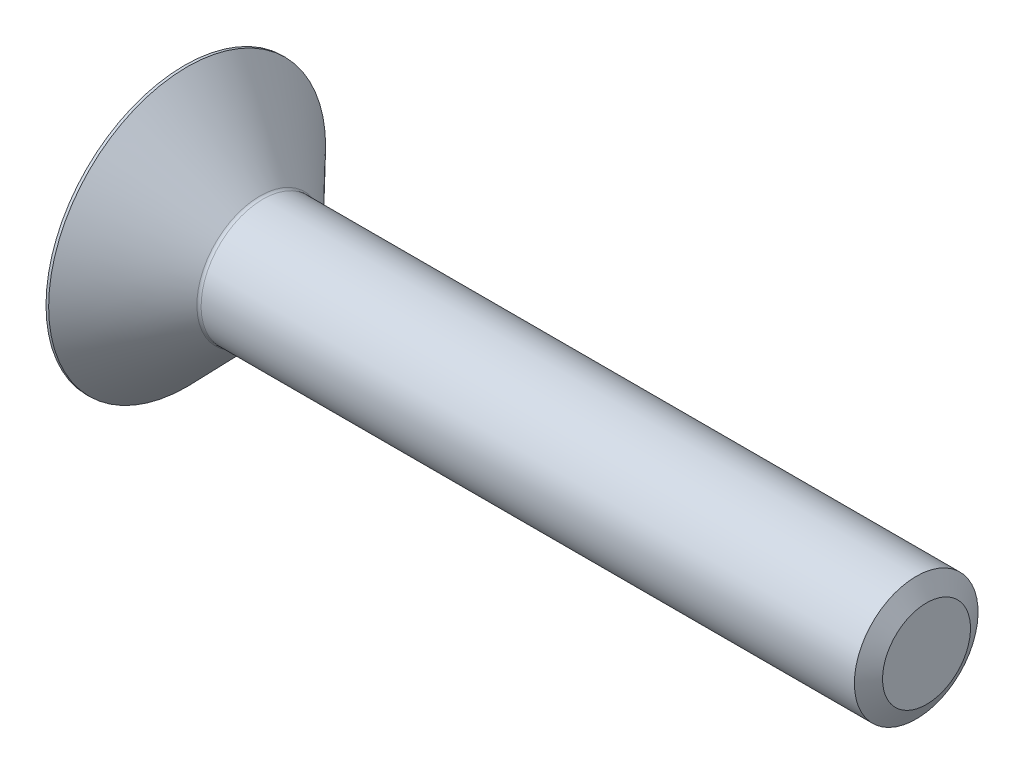
ISO-10303-21;
HEADER;
FILE_DESCRIPTION(('STEP AP214'),'2;1');
FILE_NAME('part.step','',(''),(''),'','','');
FILE_SCHEMA(('AUTOMOTIVE_DESIGN { 1 0 10303 214 1 1 1 1 }'));
ENDSEC;
DATA;
#1=APPLICATION_CONTEXT('core data for automotive mechanical design processes');
#2=APPLICATION_PROTOCOL_DEFINITION('international standard','automotive_design',2000,#1);
#3=PRODUCT_CONTEXT('',#1,'mechanical');
#4=PRODUCT('Part','Part','',(#3));
#5=PRODUCT_RELATED_PRODUCT_CATEGORY('part','',(#4));
#6=PRODUCT_DEFINITION_FORMATION('','',#4);
#7=PRODUCT_DEFINITION_CONTEXT('part definition',#1,'design');
#8=PRODUCT_DEFINITION('design','',#6,#7);
#9=PRODUCT_DEFINITION_SHAPE('','',#8);
#10=(LENGTH_UNIT() NAMED_UNIT(*) SI_UNIT(.MILLI.,.METRE.));
#11=(NAMED_UNIT(*) PLANE_ANGLE_UNIT() SI_UNIT($,.RADIAN.));
#12=(NAMED_UNIT(*) SI_UNIT($,.STERADIAN.) SOLID_ANGLE_UNIT());
#13=UNCERTAINTY_MEASURE_WITH_UNIT(LENGTH_MEASURE(1.E-05),#10,'distance_accuracy_value','');
#14=(GEOMETRIC_REPRESENTATION_CONTEXT(3) GLOBAL_UNCERTAINTY_ASSIGNED_CONTEXT((#13)) GLOBAL_UNIT_ASSIGNED_CONTEXT((#10,
#11,#12)) REPRESENTATION_CONTEXT('',''));
#15=CARTESIAN_POINT('',(0.,0.,0.));
#16=DIRECTION('',(0.,0.,1.));
#17=DIRECTION('',(1.,0.,0.));
#18=AXIS2_PLACEMENT_3D('',#15,#16,#17);
#19=CARTESIAN_POINT('',(-16.9039999999541,0.,0.));
#20=DIRECTION('',(-1.,0.,0.));
#21=DIRECTION('',(0.,0.,1.));
#22=AXIS2_PLACEMENT_3D('',#19,#20,#21);
#23=CONICAL_SURFACE('',#22,1.1616287414995,1.04719755118452);
#24=CARTESIAN_POINT('',(-16.2333333332754,0.,1.13686837721616E-10));
#25=VERTEX_POINT('',#24);
#26=VERTEX_LOOP('',#25);
#27=FACE_BOUND('',#26,.T.);
#28=CARTESIAN_POINT('',(-16.9000000000161,-1.15470053837692,4.0339967123924E-12));
#29=CARTESIAN_POINT('',(-16.8853477725791,-1.12932949060539,0.0439439437855954));
#30=CARTESIAN_POINT('',(-16.8720223385656,-1.10373944031041,0.0882672110647425));
#31=CARTESIAN_POINT('',(-16.8487631937152,-1.05211626511723,0.17768117334735));
#32=CARTESIAN_POINT('',(-16.8388377101839,-1.0260822232737,0.22277345654672));
#33=CARTESIAN_POINT('',(-16.8233879794877,-0.974336766416638,0.312399216884018));
#34=CARTESIAN_POINT('',(-16.8177608938131,-0.948633310874631,0.356918907812861));
#35=CARTESIAN_POINT('',(-16.81104458408,-0.897105519638419,0.446167660235783));
#36=CARTESIAN_POINT('',(-16.809949797002,-0.871281371105214,0.490896397557499));
#37=CARTESIAN_POINT('',(-16.8122331450927,-0.823031719919259,0.574467244859048));
#38=CARTESIAN_POINT('',(-16.8150506426236,-0.800598977013268,0.613321895325356));
#39=CARTESIAN_POINT('',(-16.8239786503747,-0.755879633203904,0.690778070884315));
#40=CARTESIAN_POINT('',(-16.8300922074001,-0.733593186857356,0.729379328276695));
#41=CARTESIAN_POINT('',(-16.8453749166851,-0.688781716982386,0.806995070861984));
#42=CARTESIAN_POINT('',(-16.8546088211251,-0.66626236208915,0.845999737690744));
#43=CARTESIAN_POINT('',(-16.8755658804358,-0.621559431337452,0.923427484999919));
#44=CARTESIAN_POINT('',(-16.8872841143922,-0.599375283224557,0.961851556654085));
#45=CARTESIAN_POINT('',(-16.9000000000161,-0.577350269191957,0.999999999995966));
#46=B_SPLINE_CURVE_WITH_KNOTS('',3,(#28,#29,#30,#31,#32,#33,#34,#35,#36,#37,#38,#39,#40,#41,#42,
#43,#44,#45),.UNSPECIFIED.,.F.,.F.,(4,2,2,2,2,2,2,2,4),(0.,0.158508005778845,0.317396908514408,
0.472353803077548,0.627120444450221,0.761853891314731,0.89671209689346,1.0345608112381,
1.17213898674875),.UNSPECIFIED.);
#47=CARTESIAN_POINT('',(-16.9000000000161,-1.15470053837692,0.));
#48=VERTEX_POINT('',#47);
#49=CARTESIAN_POINT('',(-16.9000000000168,-0.577350269190795,0.999999999997983));
#50=VERTEX_POINT('',#49);
#51=EDGE_CURVE('E21',#48,#50,#46,.T.);
#52=ORIENTED_EDGE('',*,*,#51,.T.);
#53=CARTESIAN_POINT('',(-16.9000000000161,-0.57735026918497,1.));
#54=CARTESIAN_POINT('',(-16.8863168864524,-0.529955537080034,0.999999999999876));
#55=CARTESIAN_POINT('',(-16.873789609974,-0.482185870569069,0.999999999999938));
#56=CARTESIAN_POINT('',(-16.8516492031741,-0.385870552392807,1.00000000000006));
#57=CARTESIAN_POINT('',(-16.8420425930767,-0.337323415542599,1.00000000000012));
#58=CARTESIAN_POINT('',(-16.8265940010239,-0.240773884149867,0.999999999999879));
#59=CARTESIAN_POINT('',(-16.8206696536425,-0.192785083011085,0.99999999999958));
#60=CARTESIAN_POINT('',(-16.8127165686723,-0.0965306160788095,1.00000000000042));
#61=CARTESIAN_POINT('',(-16.810683602537,-0.0482653080392742,1.00000000000156));
#62=CARTESIAN_POINT('',(-16.8106836025371,0.0482653080397529,1.00000000000156));
#63=CARTESIAN_POINT('',(-16.8127165686723,0.0965306160792449,1.00000000000042));
#64=CARTESIAN_POINT('',(-16.8206696536426,0.192785083011433,0.99999999999958));
#65=CARTESIAN_POINT('',(-16.8265940010239,0.240773884150171,0.999999999999879));
#66=CARTESIAN_POINT('',(-16.8420425930768,0.337323415542815,1.00000000000012));
#67=CARTESIAN_POINT('',(-16.8516492031742,0.385870552392978,1.00000000000006));
#68=CARTESIAN_POINT('',(-16.873789609974,0.482185870569151,0.999999999999938));
#69=CARTESIAN_POINT('',(-16.8863168864524,0.529955537080074,0.999999999999876));
#70=CARTESIAN_POINT('',(-16.9000000000161,0.577350269184966,1.));
#71=B_SPLINE_CURVE_WITH_KNOTS('',3,(#53,#54,#55,#56,#57,#58,#59,#60,#61,#62,#63,#64,#65,#66,#67,
#68,#69,#70),.UNSPECIFIED.,.F.,.F.,(4,2,2,2,2,2,2,2,4),(0.,0.148036697957628,0.296401493042135,
0.441315429581836,0.586071806658116,0.730828183734268,0.875742120273841,1.02410691535821,
1.17214361331571),.UNSPECIFIED.);
#72=CARTESIAN_POINT('',(-16.9000000000161,0.57735026918846,0.999999999997983));
#73=VERTEX_POINT('',#72);
#74=EDGE_CURVE('E82',#50,#73,#71,.T.);
#75=ORIENTED_EDGE('',*,*,#74,.T.);
#76=CARTESIAN_POINT('',(-16.9000000000161,0.577350269191953,0.999999999995966));
#77=CARTESIAN_POINT('',(-16.8853477725791,0.602721316963491,0.956056056214405));
#78=CARTESIAN_POINT('',(-16.8720223385656,0.62831136725847,0.911732788935258));
#79=CARTESIAN_POINT('',(-16.8487631937152,0.679934542451645,0.82231882665265));
#80=CARTESIAN_POINT('',(-16.8388377101839,0.705968584295175,0.777226543453281));
#81=CARTESIAN_POINT('',(-16.8233879794877,0.757714041152239,0.687600783115984));
#82=CARTESIAN_POINT('',(-16.8177608938131,0.783417496694246,0.64308109218714));
#83=CARTESIAN_POINT('',(-16.81104458408,0.834945287930458,0.553832339764219));
#84=CARTESIAN_POINT('',(-16.809949797002,0.860769436463662,0.509103602442503));
#85=CARTESIAN_POINT('',(-16.8122331450927,0.909019087649617,0.425532755140954));
#86=CARTESIAN_POINT('',(-16.8150506426236,0.931451830555608,0.386678104674646));
#87=CARTESIAN_POINT('',(-16.8239786503747,0.976171174364972,0.309221929115687));
#88=CARTESIAN_POINT('',(-16.8300922074001,0.998457620711521,0.270620671723307));
#89=CARTESIAN_POINT('',(-16.8453749166851,1.04326909058649,0.193004929138017));
#90=CARTESIAN_POINT('',(-16.8546088211251,1.06578844547973,0.154000262309257));
#91=CARTESIAN_POINT('',(-16.8755658804358,1.11049137623143,0.0765725150000815));
#92=CARTESIAN_POINT('',(-16.8872841143922,1.13267552434432,0.0381484433459156));
#93=CARTESIAN_POINT('',(-16.9000000000161,1.15470053837692,4.03385526722819E-12));
#94=B_SPLINE_CURVE_WITH_KNOTS('',3,(#76,#77,#78,#79,#80,#81,#82,#83,#84,#85,#86,#87,#88,#89,#90,
#91,#92,#93),.UNSPECIFIED.,.F.,.F.,(4,2,2,2,2,2,2,2,4),(0.,0.158508005778844,0.317396908514406,
0.472353803077547,0.627120444450219,0.761853891314729,0.896712096893458,1.0345608112381,
1.17213898674875),.UNSPECIFIED.);
#95=CARTESIAN_POINT('',(-16.9000000000161,1.15470053837692,0.));
#96=VERTEX_POINT('',#95);
#97=EDGE_CURVE('E94',#73,#96,#94,.T.);
#98=ORIENTED_EDGE('',*,*,#97,.T.);
#99=CARTESIAN_POINT('',(-16.9000000000161,1.15470053837692,-4.03331058430735E-12));
#100=CARTESIAN_POINT('',(-16.8853477725791,1.12932949060538,-0.0439439437855945));
#101=CARTESIAN_POINT('',(-16.8720223385656,1.1037394403104,-0.0882672110647415));
#102=CARTESIAN_POINT('',(-16.8487631937152,1.05211626511723,-0.177681173347349));
#103=CARTESIAN_POINT('',(-16.8388377101839,1.0260822232737,-0.222773456546718));
#104=CARTESIAN_POINT('',(-16.8233879794877,0.974336766416635,-0.312399216884015));
#105=CARTESIAN_POINT('',(-16.8177608938131,0.948633310874628,-0.356918907812859));
#106=CARTESIAN_POINT('',(-16.81104458408,0.897105519638416,-0.446167660235781));
#107=CARTESIAN_POINT('',(-16.809949797002,0.871281371105211,-0.490896397557496));
#108=CARTESIAN_POINT('',(-16.8122331450927,0.823031719919257,-0.574467244859045));
#109=CARTESIAN_POINT('',(-16.8150506426236,0.800598977013266,-0.613321895325353));
#110=CARTESIAN_POINT('',(-16.8239786503747,0.755879633203902,-0.690778070884312));
#111=CARTESIAN_POINT('',(-16.8300922074001,0.733593186857353,-0.729379328276692));
#112=CARTESIAN_POINT('',(-16.8453749166851,0.688781716982383,-0.806995070861982));
#113=CARTESIAN_POINT('',(-16.8546088211251,0.666262362089147,-0.845999737690742));
#114=CARTESIAN_POINT('',(-16.8755658804358,0.621559431337448,-0.923427484999917));
#115=CARTESIAN_POINT('',(-16.8872841143922,0.599375283224554,-0.961851556654083));
#116=CARTESIAN_POINT('',(-16.9000000000161,0.577350269191954,-0.999999999995965));
#117=B_SPLINE_CURVE_WITH_KNOTS('',3,(#99,#100,#101,#102,#103,#104,#105,#106,#107,#108,#109,#110,
#111,#112,#113,#114,#115,#116),.UNSPECIFIED.,.F.,.F.,(4,2,2,2,2,2,2,2,4),(0.,0.158508005778844,
0.317396908514406,0.472353803077546,0.627120444450219,0.761853891314728,0.896712096893457,
1.03456081123809,1.17213898674875),.UNSPECIFIED.);
#118=CARTESIAN_POINT('',(-16.9000000000161,0.577350269188461,-0.999999999997983));
#119=VERTEX_POINT('',#118);
#120=EDGE_CURVE('E101',#96,#119,#117,.T.);
#121=ORIENTED_EDGE('',*,*,#120,.T.);
#122=CARTESIAN_POINT('',(-16.9000000000161,0.577350269184967,-1.));
#123=CARTESIAN_POINT('',(-16.8863168864524,0.529955537080106,-0.999999999999876));
#124=CARTESIAN_POINT('',(-16.873789609974,0.482185870569216,-0.999999999999938));
#125=CARTESIAN_POINT('',(-16.8516492031742,0.385870552393109,-1.00000000000006));
#126=CARTESIAN_POINT('',(-16.8420425930768,0.337323415542979,-1.00000000000012));
#127=CARTESIAN_POINT('',(-16.8265940010239,0.240773884150401,-0.999999999999879));
#128=CARTESIAN_POINT('',(-16.8206696536426,0.192785083011696,-0.99999999999958));
#129=CARTESIAN_POINT('',(-16.8127165686724,0.096530616079572,-1.00000000000042));
#130=CARTESIAN_POINT('',(-16.8106836025371,0.0482653080401124,-1.00000000000156));
#131=CARTESIAN_POINT('',(-16.810683602537,-0.0482653080389148,-1.00000000000156));
#132=CARTESIAN_POINT('',(-16.8127165686723,-0.0965306160784825,-1.00000000000042));
#133=CARTESIAN_POINT('',(-16.8206696536425,-0.192785083010823,-0.99999999999958));
#134=CARTESIAN_POINT('',(-16.8265940010238,-0.240773884149637,-0.999999999999879));
#135=CARTESIAN_POINT('',(-16.8420425930767,-0.337323415542435,-1.00000000000012));
#136=CARTESIAN_POINT('',(-16.8516492031741,-0.385870552392677,-1.00000000000006));
#137=CARTESIAN_POINT('',(-16.8737896099739,-0.482185870569004,-0.999999999999938));
#138=CARTESIAN_POINT('',(-16.8863168864524,-0.529955537080002,-0.999999999999876));
#139=CARTESIAN_POINT('',(-16.9000000000161,-0.577350269184969,-1.));
#140=B_SPLINE_CURVE_WITH_KNOTS('',3,(#122,#123,#124,#125,#126,#127,#128,#129,#130,#131,#132,
#133,#134,#135,#136,#137,#138,#139),.UNSPECIFIED.,.F.,.F.,(4,2,2,2,2,2,2,2,4),(0.,
0.148036697957395,0.296401493041668,0.441315429581145,0.586071806657201,0.730828183733577,
0.875742120273374,1.02410691535798,1.17214361331571),.UNSPECIFIED.);
#141=CARTESIAN_POINT('',(-16.9000000000161,-0.577350269188463,-0.999999999997983));
#142=VERTEX_POINT('',#141);
#143=EDGE_CURVE('E104',#119,#142,#140,.T.);
#144=ORIENTED_EDGE('',*,*,#143,.T.);
#145=CARTESIAN_POINT('',(-16.9000000000161,-0.577350269191957,-0.999999999995966));
#146=CARTESIAN_POINT('',(-16.8853477725791,-0.602721316963495,-0.956056056214404));
#147=CARTESIAN_POINT('',(-16.8720223385656,-0.628311367258474,-0.911732788935257));
#148=CARTESIAN_POINT('',(-16.8487631937152,-0.679934542451649,-0.82231882665265));
#149=CARTESIAN_POINT('',(-16.8388377101839,-0.70596858429518,-0.777226543453281));
#150=CARTESIAN_POINT('',(-16.8233879794877,-0.757714041152243,-0.687600783115983));
#151=CARTESIAN_POINT('',(-16.8177608938131,-0.78341749669425,-0.64308109218714));
#152=CARTESIAN_POINT('',(-16.81104458408,-0.834945287930462,-0.553832339764218));
#153=CARTESIAN_POINT('',(-16.809949797002,-0.860769436463667,-0.509103602442502));
#154=CARTESIAN_POINT('',(-16.8122331450927,-0.909019087649621,-0.425532755140953));
#155=CARTESIAN_POINT('',(-16.8150506426236,-0.931451830555613,-0.386678104674645));
#156=CARTESIAN_POINT('',(-16.8239786503747,-0.976171174364977,-0.309221929115686));
#157=CARTESIAN_POINT('',(-16.8300922074001,-0.998457620711525,-0.270620671723307));
#158=CARTESIAN_POINT('',(-16.8453749166851,-1.0432690905865,-0.193004929138016));
#159=CARTESIAN_POINT('',(-16.8546088211251,-1.06578844547973,-0.154000262309256));
#160=CARTESIAN_POINT('',(-16.8755658804358,-1.11049137623143,-0.0765725150000809));
#161=CARTESIAN_POINT('',(-16.8872841143922,-1.13267552434432,-0.0381484433459151));
#162=CARTESIAN_POINT('',(-16.9000000000161,-1.15470053837692,-4.0342541360767E-12));
#163=B_SPLINE_CURVE_WITH_KNOTS('',3,(#145,#146,#147,#148,#149,#150,#151,#152,#153,#154,#155,
#156,#157,#158,#159,#160,#161,#162),.UNSPECIFIED.,.F.,.F.,(4,2,2,2,2,2,2,2,4),(0.,
0.158508005778843,0.317396908514406,0.472353803077546,0.627120444450219,0.761853891314729,
0.896712096893458,1.03456081123809,1.17213898674875),.UNSPECIFIED.);
#164=EDGE_CURVE('E74',#142,#48,#163,.T.);
#165=ORIENTED_EDGE('',*,*,#164,.T.);
#166=EDGE_LOOP('',(#52,#75,#98,#121,#144,#165));
#167=FACE_BOUND('',#166,.T.);
#168=ADVANCED_FACE('F17',(#27,#167),#23,.F.);
#169=CARTESIAN_POINT('',(-16.04,-1.15470053837925,0.));
#170=DIRECTION('',(0.,-0.866025403784439,0.5));
#171=DIRECTION('',(0.,-0.5,-0.866025403784439));
#172=AXIS2_PLACEMENT_3D('',#169,#170,#171);
#173=PLANE('',#172);
#174=DIRECTION('',(1.,0.,0.));
#175=VECTOR('',#174,1.);
#176=CARTESIAN_POINT('',(-16.04,-0.577350269189633,1.));
#177=LINE('',#176,#175);
#178=CARTESIAN_POINT('',(-17.9999999999999,-0.577350269189771,1.00000000000002));
#179=VERTEX_POINT('',#178);
#180=EDGE_CURVE('E86',#179,#50,#177,.T.);
#181=ORIENTED_EDGE('',*,*,#180,.T.);
#182=ORIENTED_EDGE('',*,*,#51,.F.);
#183=DIRECTION('',(1.,0.,0.));
#184=VECTOR('',#183,1.);
#185=CARTESIAN_POINT('',(-16.04,-1.15470053837925,0.));
#186=LINE('',#185,#184);
#187=CARTESIAN_POINT('',(-17.9999999999999,-1.15470053837933,0.));
#188=VERTEX_POINT('',#187);
#189=EDGE_CURVE('E105',#48,#188,#186,.F.);
#190=ORIENTED_EDGE('',*,*,#189,.T.);
#191=CARTESIAN_POINT('',(-17.9999999999999,-1.15470053837928,0.));
#192=CARTESIAN_POINT('',(-17.9931485433512,-1.1307355483116,0.0415085804000621));
#193=CARTESIAN_POINT('',(-17.9869265071695,-1.106721247571,0.0831025693910098));
#194=CARTESIAN_POINT('',(-17.9759925259882,-1.05859621230057,0.166457575595438));
#195=CARTESIAN_POINT('',(-17.9712812836437,-1.03448543816468,0.208218661408625));
#196=CARTESIAN_POINT('',(-17.9636494177607,-0.986333519050269,0.291620231796733));
#197=CARTESIAN_POINT('',(-17.9607184564333,-0.962292794802696,0.333259987644283));
#198=CARTESIAN_POINT('',(-17.9567881534659,-0.914176509020636,0.416599839290315));
#199=CARTESIAN_POINT('',(-17.9557883832487,-0.890100956402539,0.458299919645156));
#200=CARTESIAN_POINT('',(-17.9557883832487,-0.841949851166346,0.541700080354839));
#201=CARTESIAN_POINT('',(-17.9567881534659,-0.817874298548249,0.58340016070968));
#202=CARTESIAN_POINT('',(-17.9607184564333,-0.769758012766189,0.666740012355712));
#203=CARTESIAN_POINT('',(-17.9636494177607,-0.745717288518616,0.708379768203262));
#204=CARTESIAN_POINT('',(-17.9712812836437,-0.697565369404204,0.79178133859137));
#205=CARTESIAN_POINT('',(-17.9759925259882,-0.673454595268309,0.833542424404557));
#206=CARTESIAN_POINT('',(-17.9869265071695,-0.62532955999788,0.916897430608986));
#207=CARTESIAN_POINT('',(-17.9931485433512,-0.601315259257286,0.958491419599933));
#208=CARTESIAN_POINT('',(-17.9999999999999,-0.577350269189609,1.00000000000003));
#209=B_SPLINE_CURVE_WITH_KNOTS('',3,(#191,#192,#193,#194,#195,#196,#197,#198,#199,#200,#201,
#202,#203,#204,#205,#206,#207,#208),.UNSPECIFIED.,.F.,.F.,(4,2,2,2,2,2,2,2,4),(0.,
0.145260358344985,0.290588178163771,0.435063828864236,0.579507413305438,0.72395099774664,
0.868426648447105,1.01375446826589,1.15901482661088),.UNSPECIFIED.);
#210=EDGE_CURVE('E88',#188,#179,#209,.T.);
#211=ORIENTED_EDGE('',*,*,#210,.T.);
#212=EDGE_LOOP('',(#181,#182,#190,#211));
#213=FACE_BOUND('',#212,.T.);
#214=ADVANCED_FACE('F79',(#213),#173,.F.);
#215=CARTESIAN_POINT('',(-16.04,-0.577350269189628,-1.));
#216=DIRECTION('',(0.,-0.866025403784439,-0.5));
#217=DIRECTION('',(0.,0.5,-0.866025403784439));
#218=AXIS2_PLACEMENT_3D('',#215,#216,#217);
#219=PLANE('',#218);
#220=ORIENTED_EDGE('',*,*,#189,.F.);
#221=ORIENTED_EDGE('',*,*,#164,.F.);
#222=DIRECTION('',(-1.,0.,0.));
#223=VECTOR('',#222,1.);
#224=CARTESIAN_POINT('',(-16.04,-0.577350269189628,-1.));
#225=LINE('',#224,#223);
#226=CARTESIAN_POINT('',(-17.9999999999999,-0.577350269189669,-1.00000000000006));
#227=VERTEX_POINT('',#226);
#228=EDGE_CURVE('E102',#142,#227,#225,.T.);
#229=ORIENTED_EDGE('',*,*,#228,.T.);
#230=CARTESIAN_POINT('',(-17.9999999999999,-0.577350269189609,-1.00000000000003));
#231=CARTESIAN_POINT('',(-17.9931485433512,-0.601315259257285,-0.958491419599933));
#232=CARTESIAN_POINT('',(-17.9869265071695,-0.625329559997879,-0.916897430608986));
#233=CARTESIAN_POINT('',(-17.9759925259882,-0.673454595268309,-0.833542424404558));
#234=CARTESIAN_POINT('',(-17.9712812836437,-0.697565369404204,-0.791781338591371));
#235=CARTESIAN_POINT('',(-17.9636494177607,-0.745717288518615,-0.708379768203263));
#236=CARTESIAN_POINT('',(-17.9607184564333,-0.769758012766189,-0.666740012355713));
#237=CARTESIAN_POINT('',(-17.9567881534659,-0.817874298548249,-0.583400160709681));
#238=CARTESIAN_POINT('',(-17.9557883832487,-0.841949851166345,-0.54170008035484));
#239=CARTESIAN_POINT('',(-17.9557883832487,-0.890100956402539,-0.458299919645157));
#240=CARTESIAN_POINT('',(-17.9567881534659,-0.914176509020636,-0.416599839290315));
#241=CARTESIAN_POINT('',(-17.9607184564333,-0.962292794802696,-0.333259987644283));
#242=CARTESIAN_POINT('',(-17.9636494177607,-0.986333519050269,-0.291620231796734));
#243=CARTESIAN_POINT('',(-17.9712812836437,-1.03448543816468,-0.208218661408626));
#244=CARTESIAN_POINT('',(-17.9759925259882,-1.05859621230057,-0.166457575595439));
#245=CARTESIAN_POINT('',(-17.9869265071695,-1.106721247571,-0.0831025693910105));
#246=CARTESIAN_POINT('',(-17.9931485433512,-1.1307355483116,-0.0415085804000627));
#247=CARTESIAN_POINT('',(-17.9999999999999,-1.15470053837928,0.));
#248=B_SPLINE_CURVE_WITH_KNOTS('',3,(#230,#231,#232,#233,#234,#235,#236,#237,#238,#239,#240,
#241,#242,#243,#244,#245,#246,#247),.UNSPECIFIED.,.F.,.F.,(4,2,2,2,2,2,2,2,4),(0.,
0.145260358344985,0.290588178163772,0.435063828864236,0.579507413305438,0.723950997746641,
0.868426648447105,1.01375446826589,1.15901482661088),.UNSPECIFIED.);
#249=EDGE_CURVE('E214',#227,#188,#248,.T.);
#250=ORIENTED_EDGE('',*,*,#249,.T.);
#251=EDGE_LOOP('',(#220,#221,#229,#250));
#252=FACE_BOUND('',#251,.T.);
#253=ADVANCED_FACE('F208',(#252),#219,.F.);
#254=CARTESIAN_POINT('',(-16.04,0.577350269189624,-1.));
#255=DIRECTION('',(0.,0.,-1.));
#256=DIRECTION('',(-1.,0.,0.));
#257=AXIS2_PLACEMENT_3D('',#254,#255,#256);
#258=PLANE('',#257);
#259=ORIENTED_EDGE('',*,*,#228,.F.);
#260=ORIENTED_EDGE('',*,*,#143,.F.);
#261=DIRECTION('',(1.,0.,0.));
#262=VECTOR('',#261,1.);
#263=CARTESIAN_POINT('',(-16.04,0.577350269189625,-0.999999999999998));
#264=LINE('',#263,#262);
#265=CARTESIAN_POINT('',(-17.9999999999999,0.577350269189663,-1.00000000000007));
#266=VERTEX_POINT('',#265);
#267=EDGE_CURVE('E99',#119,#266,#264,.F.);
#268=ORIENTED_EDGE('',*,*,#267,.T.);
#269=CARTESIAN_POINT('',(-17.9999999999999,0.577350269189668,-1.));
#270=CARTESIAN_POINT('',(-17.9931485433512,0.529420289054314,-1.));
#271=CARTESIAN_POINT('',(-17.9869265071695,0.481391687573126,-1.));
#272=CARTESIAN_POINT('',(-17.9759925259882,0.385141617032266,-1.));
#273=CARTESIAN_POINT('',(-17.9712812836437,0.336920068760476,-1.));
#274=CARTESIAN_POINT('',(-17.9636494177607,0.240616230531651,-1.));
#275=CARTESIAN_POINT('',(-17.9607184564333,0.192534782036505,-1.));
#276=CARTESIAN_POINT('',(-17.9567881534659,0.0963022104723835,-1.));
#277=CARTESIAN_POINT('',(-17.9557883832487,0.0481511052361896,-1.));
#278=CARTESIAN_POINT('',(-17.9557883832487,-0.0481511052361983,-1.));
#279=CARTESIAN_POINT('',(-17.9567881534659,-0.0963022104723922,-1.));
#280=CARTESIAN_POINT('',(-17.9607184564333,-0.192534782036513,-1.));
#281=CARTESIAN_POINT('',(-17.9636494177607,-0.24061623053166,-1.));
#282=CARTESIAN_POINT('',(-17.9712812836437,-0.336920068760484,-1.));
#283=CARTESIAN_POINT('',(-17.9759925259882,-0.385141617032274,-1.));
#284=CARTESIAN_POINT('',(-17.9869265071695,-0.481391687573134,-1.));
#285=CARTESIAN_POINT('',(-17.9931485433512,-0.529420289054323,-1.));
#286=CARTESIAN_POINT('',(-17.9999999999999,-0.577350269189676,-1.));
#287=B_SPLINE_CURVE_WITH_KNOTS('',3,(#269,#270,#271,#272,#273,#274,#275,#276,#277,#278,#279,
#280,#281,#282,#283,#284,#285,#286),.UNSPECIFIED.,.F.,.F.,(4,2,2,2,2,2,2,2,4),(0.,
0.145260358344988,0.290588178163777,0.435063828864243,0.579507413305447,0.723950997746651,
0.868426648447117,1.01375446826591,1.15901482661089),.UNSPECIFIED.);
#288=EDGE_CURVE('E176',#266,#227,#287,.T.);
#289=ORIENTED_EDGE('',*,*,#288,.T.);
#290=EDGE_LOOP('',(#259,#260,#268,#289));
#291=FACE_BOUND('',#290,.T.);
#292=ADVANCED_FACE('F186',(#291),#258,.F.);
#293=CARTESIAN_POINT('',(-16.04,1.15470053837925,0.));
#294=DIRECTION('',(0.,0.866025403784439,-0.5));
#295=DIRECTION('',(0.,0.5,0.866025403784439));
#296=AXIS2_PLACEMENT_3D('',#293,#294,#295);
#297=PLANE('',#296);
#298=ORIENTED_EDGE('',*,*,#267,.F.);
#299=ORIENTED_EDGE('',*,*,#120,.F.);
#300=DIRECTION('',(1.,0.,0.));
#301=VECTOR('',#300,1.);
#302=CARTESIAN_POINT('',(-16.04,1.15470053837925,0.));
#303=LINE('',#302,#301);
#304=CARTESIAN_POINT('',(-17.9999999999999,1.15470053837933,0.));
#305=VERTEX_POINT('',#304);
#306=EDGE_CURVE('E90',#96,#305,#303,.F.);
#307=ORIENTED_EDGE('',*,*,#306,.T.);
#308=CARTESIAN_POINT('',(-17.9999999999999,1.15470053837927,0.));
#309=CARTESIAN_POINT('',(-17.9931485433512,1.13073554831159,-0.0415085804000635));
#310=CARTESIAN_POINT('',(-17.9869265071695,1.106721247571,-0.0831025693910112));
#311=CARTESIAN_POINT('',(-17.9759925259882,1.05859621230057,-0.16645757559544));
#312=CARTESIAN_POINT('',(-17.9712812836437,1.03448543816467,-0.208218661408627));
#313=CARTESIAN_POINT('',(-17.9636494177607,0.986333519050263,-0.291620231796735));
#314=CARTESIAN_POINT('',(-17.9607184564333,0.96229279480269,-0.333259987644286));
#315=CARTESIAN_POINT('',(-17.9567881534659,0.91417650902063,-0.416599839290318));
#316=CARTESIAN_POINT('',(-17.9557883832487,0.890100956402533,-0.45829991964516));
#317=CARTESIAN_POINT('',(-17.9557883832487,0.841949851166339,-0.541700080354843));
#318=CARTESIAN_POINT('',(-17.9567881534659,0.817874298548242,-0.583400160709684));
#319=CARTESIAN_POINT('',(-17.9607184564333,0.769758012766182,-0.666740012355717));
#320=CARTESIAN_POINT('',(-17.9636494177607,0.745717288518609,-0.708379768203267));
#321=CARTESIAN_POINT('',(-17.9712812836437,0.697565369404197,-0.791781338591375));
#322=CARTESIAN_POINT('',(-17.9759925259882,0.673454595268302,-0.833542424404562));
#323=CARTESIAN_POINT('',(-17.9869265071695,0.625329559997873,-0.916897430608991));
#324=CARTESIAN_POINT('',(-17.9931485433512,0.601315259257279,-0.958491419599939));
#325=CARTESIAN_POINT('',(-17.9999999999999,0.577350269189602,-1.00000000000004));
#326=B_SPLINE_CURVE_WITH_KNOTS('',3,(#308,#309,#310,#311,#312,#313,#314,#315,#316,#317,#318,
#319,#320,#321,#322,#323,#324,#325),.UNSPECIFIED.,.F.,.F.,(4,2,2,2,2,2,2,2,4),(0.,
0.145260358344986,0.290588178163773,0.435063828864238,0.579507413305441,0.723950997746644,
0.868426648447109,1.0137544682659,1.15901482661088),.UNSPECIFIED.);
#327=EDGE_CURVE('E169',#305,#266,#326,.T.);
#328=ORIENTED_EDGE('',*,*,#327,.T.);
#329=EDGE_LOOP('',(#298,#299,#307,#328));
#330=FACE_BOUND('',#329,.T.);
#331=ADVANCED_FACE('F182',(#330),#297,.F.);
#332=CARTESIAN_POINT('',(-16.04,0.577350269189624,1.));
#333=DIRECTION('',(0.,0.866025403784439,0.5));
#334=DIRECTION('',(0.,-0.5,0.866025403784439));
#335=AXIS2_PLACEMENT_3D('',#332,#333,#334);
#336=PLANE('',#335);
#337=ORIENTED_EDGE('',*,*,#306,.F.);
#338=ORIENTED_EDGE('',*,*,#97,.F.);
#339=DIRECTION('',(1.,0.,0.));
#340=VECTOR('',#339,1.);
#341=CARTESIAN_POINT('',(-16.04,0.577350269189624,1.));
#342=LINE('',#341,#340);
#343=CARTESIAN_POINT('',(-17.9999999999999,0.577350269189664,1.00000000000007));
#344=VERTEX_POINT('',#343);
#345=EDGE_CURVE('E92',#73,#344,#342,.F.);
#346=ORIENTED_EDGE('',*,*,#345,.T.);
#347=CARTESIAN_POINT('',(-17.9999999999999,0.577350269189603,1.00000000000004));
#348=CARTESIAN_POINT('',(-17.9931485433512,0.60131525925728,0.958491419599935));
#349=CARTESIAN_POINT('',(-17.9869265071695,0.625329559997874,0.916897430608987));
#350=CARTESIAN_POINT('',(-17.9759925259882,0.673454595268304,0.833542424404559));
#351=CARTESIAN_POINT('',(-17.9712812836437,0.697565369404199,0.791781338591371));
#352=CARTESIAN_POINT('',(-17.9636494177607,0.745717288518611,0.708379768203263));
#353=CARTESIAN_POINT('',(-17.9607184564333,0.769758012766184,0.666740012355713));
#354=CARTESIAN_POINT('',(-17.9567881534659,0.817874298548245,0.58340016070968));
#355=CARTESIAN_POINT('',(-17.9557883832487,0.841949851166342,0.541700080354838));
#356=CARTESIAN_POINT('',(-17.9557883832487,0.890100956402535,0.458299919645155));
#357=CARTESIAN_POINT('',(-17.9567881534659,0.914176509020632,0.416599839290313));
#358=CARTESIAN_POINT('',(-17.9607184564333,0.962292794802693,0.333259987644281));
#359=CARTESIAN_POINT('',(-17.9636494177607,0.986333519050266,0.291620231796731));
#360=CARTESIAN_POINT('',(-17.9712812836437,1.03448543816468,0.208218661408623));
#361=CARTESIAN_POINT('',(-17.9759925259882,1.05859621230057,0.166457575595435));
#362=CARTESIAN_POINT('',(-17.9869265071695,1.106721247571,0.0831025693910063));
#363=CARTESIAN_POINT('',(-17.9931485433512,1.1307355483116,0.0415085804000584));
#364=CARTESIAN_POINT('',(-17.9999999999999,1.15470053837927,0.));
#365=B_SPLINE_CURVE_WITH_KNOTS('',3,(#347,#348,#349,#350,#351,#352,#353,#354,#355,#356,#357,
#358,#359,#360,#361,#362,#363,#364),.UNSPECIFIED.,.F.,.F.,(4,2,2,2,2,2,2,2,4),(0.,
0.145260358344986,0.290588178163773,0.435063828864239,0.579507413305442,0.723950997746646,
0.868426648447111,1.0137544682659,1.15901482661088),.UNSPECIFIED.);
#366=EDGE_CURVE('E139',#344,#305,#365,.T.);
#367=ORIENTED_EDGE('',*,*,#366,.T.);
#368=EDGE_LOOP('',(#337,#338,#346,#367));
#369=FACE_BOUND('',#368,.T.);
#370=ADVANCED_FACE('F185',(#369),#336,.F.);
#371=CARTESIAN_POINT('',(-16.04,-0.577350269189628,1.));
#372=DIRECTION('',(0.,0.,1.));
#373=DIRECTION('',(1.,0.,0.));
#374=AXIS2_PLACEMENT_3D('',#371,#372,#373);
#375=PLANE('',#374);
#376=ORIENTED_EDGE('',*,*,#345,.F.);
#377=ORIENTED_EDGE('',*,*,#74,.F.);
#378=ORIENTED_EDGE('',*,*,#180,.F.);
#379=CARTESIAN_POINT('',(-17.9999999999999,-0.577350269189677,1.));
#380=CARTESIAN_POINT('',(-17.9931485433512,-0.529420289054324,1.));
#381=CARTESIAN_POINT('',(-17.9869265071695,-0.481391687573136,1.));
#382=CARTESIAN_POINT('',(-17.9759925259882,-0.385141617032275,1.));
#383=CARTESIAN_POINT('',(-17.9712812836437,-0.336920068760484,1.));
#384=CARTESIAN_POINT('',(-17.9636494177607,-0.240616230531659,1.));
#385=CARTESIAN_POINT('',(-17.9607184564333,-0.192534782036513,1.));
#386=CARTESIAN_POINT('',(-17.9567881534659,-0.0963022104723928,1.));
#387=CARTESIAN_POINT('',(-17.9557883832487,-0.0481511052362001,1.));
#388=CARTESIAN_POINT('',(-17.9557883832487,0.0481511052361859,1.));
#389=CARTESIAN_POINT('',(-17.9567881534659,0.0963022104723793,1.));
#390=CARTESIAN_POINT('',(-17.9607184564333,0.192534782036501,1.));
#391=CARTESIAN_POINT('',(-17.9636494177607,0.240616230531648,1.));
#392=CARTESIAN_POINT('',(-17.9712812836437,0.336920068760475,1.));
#393=CARTESIAN_POINT('',(-17.9759925259882,0.385141617032266,1.));
#394=CARTESIAN_POINT('',(-17.9869265071695,0.481391687573128,1.));
#395=CARTESIAN_POINT('',(-17.9931485433512,0.529420289054317,1.));
#396=CARTESIAN_POINT('',(-17.9999999999999,0.577350269189671,1.));
#397=B_SPLINE_CURVE_WITH_KNOTS('',3,(#379,#380,#381,#382,#383,#384,#385,#386,#387,#388,#389,
#390,#391,#392,#393,#394,#395,#396),.UNSPECIFIED.,.F.,.F.,(4,2,2,2,2,2,2,2,4),(0.,
0.145260358344985,0.290588178163776,0.435063828864241,0.579507413305442,0.723950997746646,
0.868426648447113,1.01375446826591,1.15901482661089),.UNSPECIFIED.);
#398=EDGE_CURVE('E39',#179,#344,#397,.T.);
#399=ORIENTED_EDGE('',*,*,#398,.T.);
#400=EDGE_LOOP('',(#376,#377,#378,#399));
#401=FACE_BOUND('',#400,.T.);
#402=ADVANCED_FACE('F146',(#401),#375,.F.);
#403=CARTESIAN_POINT('',(-17.9999999999997,0.,0.));
#404=DIRECTION('',(-1.,0.,0.));
#405=DIRECTION('',(0.,0.,1.));
#406=AXIS2_PLACEMENT_3D('',#403,#404,#405);
#407=CONICAL_SURFACE('',#406,1.15470053837852,1.2924281638628);
#408=CARTESIAN_POINT('',(-17.9999999999999,0.,0.));
#409=DIRECTION('',(-1.,0.,0.));
#410=DIRECTION('',(0.,0.,1.));
#411=AXIS2_PLACEMENT_3D('',#408,#409,#410);
#412=CIRCLE('',#411,1.15470053837941);
#413=EDGE_CURVE('E130',#179,#188,#412,.F.);
#414=ORIENTED_EDGE('',*,*,#413,.F.);
#415=ORIENTED_EDGE('',*,*,#210,.F.);
#416=EDGE_LOOP('',(#414,#415));
#417=FACE_BOUND('',#416,.T.);
#418=ADVANCED_FACE('F226',(#417),#407,.F.);
#419=CARTESIAN_POINT('',(-17.9999999999997,0.,0.));
#420=DIRECTION('',(-1.,0.,0.));
#421=DIRECTION('',(0.,0.,1.));
#422=AXIS2_PLACEMENT_3D('',#419,#420,#421);
#423=CONICAL_SURFACE('',#422,1.15470053837852,1.2924281638628);
#424=CARTESIAN_POINT('',(-17.9999999999999,0.,0.));
#425=DIRECTION('',(-1.,0.,0.));
#426=DIRECTION('',(0.,0.,1.));
#427=AXIS2_PLACEMENT_3D('',#424,#425,#426);
#428=CIRCLE('',#427,1.15470053837941);
#429=EDGE_CURVE('E127',#188,#227,#428,.F.);
#430=ORIENTED_EDGE('',*,*,#429,.F.);
#431=ORIENTED_EDGE('',*,*,#249,.F.);
#432=EDGE_LOOP('',(#430,#431));
#433=FACE_BOUND('',#432,.T.);
#434=ADVANCED_FACE('F223',(#433),#423,.F.);
#435=CARTESIAN_POINT('',(-17.9999999999997,0.,0.));
#436=DIRECTION('',(-1.,0.,0.));
#437=DIRECTION('',(0.,0.,1.));
#438=AXIS2_PLACEMENT_3D('',#435,#436,#437);
#439=CONICAL_SURFACE('',#438,1.15470053837852,1.29242816386264);
#440=CARTESIAN_POINT('',(-17.9999999999999,0.,0.));
#441=DIRECTION('',(-1.,0.,0.));
#442=DIRECTION('',(0.,0.,1.));
#443=AXIS2_PLACEMENT_3D('',#440,#441,#442);
#444=CIRCLE('',#443,1.1547005383794);
#445=EDGE_CURVE('E124',#227,#266,#444,.F.);
#446=ORIENTED_EDGE('',*,*,#445,.F.);
#447=ORIENTED_EDGE('',*,*,#288,.F.);
#448=EDGE_LOOP('',(#446,#447));
#449=FACE_BOUND('',#448,.T.);
#450=ADVANCED_FACE('F165',(#449),#439,.F.);
#451=CARTESIAN_POINT('',(-17.9999999999997,0.,0.));
#452=DIRECTION('',(-1.,0.,0.));
#453=DIRECTION('',(0.,0.,1.));
#454=AXIS2_PLACEMENT_3D('',#451,#452,#453);
#455=CONICAL_SURFACE('',#454,1.15470053837852,1.2924281638628);
#456=CARTESIAN_POINT('',(-17.9999999999999,0.,0.));
#457=DIRECTION('',(-1.,0.,0.));
#458=DIRECTION('',(0.,0.,1.));
#459=AXIS2_PLACEMENT_3D('',#456,#457,#458);
#460=CIRCLE('',#459,1.1547005383794);
#461=EDGE_CURVE('E121',#266,#305,#460,.F.);
#462=ORIENTED_EDGE('',*,*,#461,.F.);
#463=ORIENTED_EDGE('',*,*,#327,.F.);
#464=EDGE_LOOP('',(#462,#463));
#465=FACE_BOUND('',#464,.T.);
#466=ADVANCED_FACE('F160',(#465),#455,.F.);
#467=CARTESIAN_POINT('',(-17.9999999999997,0.,0.));
#468=DIRECTION('',(-1.,0.,0.));
#469=DIRECTION('',(0.,0.,1.));
#470=AXIS2_PLACEMENT_3D('',#467,#468,#469);
#471=CONICAL_SURFACE('',#470,1.15470053837852,1.2924281638628);
#472=CARTESIAN_POINT('',(-17.9999999999999,0.,0.));
#473=DIRECTION('',(-1.,0.,0.));
#474=DIRECTION('',(0.,0.,1.));
#475=AXIS2_PLACEMENT_3D('',#472,#473,#474);
#476=CIRCLE('',#475,1.15470053837941);
#477=EDGE_CURVE('E118',#305,#344,#476,.F.);
#478=ORIENTED_EDGE('',*,*,#477,.F.);
#479=ORIENTED_EDGE('',*,*,#366,.F.);
#480=EDGE_LOOP('',(#478,#479));
#481=FACE_BOUND('',#480,.T.);
#482=ADVANCED_FACE('F154',(#481),#471,.F.);
#483=CARTESIAN_POINT('',(-17.9999999999997,0.,0.));
#484=DIRECTION('',(-1.,0.,0.));
#485=DIRECTION('',(0.,0.,1.));
#486=AXIS2_PLACEMENT_3D('',#483,#484,#485);
#487=CONICAL_SURFACE('',#486,1.15470053837852,1.29242816386288);
#488=ORIENTED_EDGE('',*,*,#398,.F.);
#489=CARTESIAN_POINT('',(-17.9999999999999,0.,0.));
#490=DIRECTION('',(-1.,0.,0.));
#491=DIRECTION('',(0.,0.,1.));
#492=AXIS2_PLACEMENT_3D('',#489,#490,#491);
#493=CIRCLE('',#492,1.15470053837941);
#494=EDGE_CURVE('E115',#344,#179,#493,.F.);
#495=ORIENTED_EDGE('',*,*,#494,.F.);
#496=EDGE_LOOP('',(#488,#495));
#497=FACE_BOUND('',#496,.T.);
#498=ADVANCED_FACE('F149',(#497),#487,.F.);
#499=CARTESIAN_POINT('',(-18.,3.36,0.));
#500=DIRECTION('',(-1.,0.,0.));
#501=DIRECTION('',(0.,-1.,0.));
#502=AXIS2_PLACEMENT_3D('',#499,#500,#501);
#503=PLANE('',#502);
#504=ORIENTED_EDGE('',*,*,#477,.T.);
#505=ORIENTED_EDGE('',*,*,#494,.T.);
#506=ORIENTED_EDGE('',*,*,#413,.T.);
#507=ORIENTED_EDGE('',*,*,#429,.T.);
#508=ORIENTED_EDGE('',*,*,#445,.T.);
#509=ORIENTED_EDGE('',*,*,#461,.T.);
#510=EDGE_LOOP('',(#504,#505,#506,#507,#508,#509));
#511=FACE_BOUND('',#510,.T.);
#512=CARTESIAN_POINT('',(-18.,0.,0.));
#513=DIRECTION('',(1.,0.,0.));
#514=DIRECTION('',(0.,1.,0.));
#515=AXIS2_PLACEMENT_3D('',#512,#513,#514);
#516=CIRCLE('',#515,3.36);
#517=CARTESIAN_POINT('',(-18.,3.36,0.));
#518=VERTEX_POINT('',#517);
#519=EDGE_CURVE('E111',#518,#518,#516,.T.);
#520=ORIENTED_EDGE('',*,*,#519,.F.);
#521=EDGE_LOOP('',(#520));
#522=FACE_BOUND('',#521,.T.);
#523=ADVANCED_FACE('F153',(#511,#522),#503,.T.);
#524=CARTESIAN_POINT('',(0.,0.,0.));
#525=DIRECTION('',(1.,0.,0.));
#526=DIRECTION('',(0.,1.,0.));
#527=AXIS2_PLACEMENT_3D('',#524,#525,#526);
#528=CYLINDRICAL_SURFACE('',#527,3.36);
#529=CARTESIAN_POINT('',(-17.9361811211152,0.,0.));
#530=DIRECTION('',(-1.,0.,0.));
#531=DIRECTION('',(0.,-1.,0.));
#532=AXIS2_PLACEMENT_3D('',#529,#530,#531);
#533=CIRCLE('',#532,3.35999999998648);
#534=CARTESIAN_POINT('',(-17.9361811211152,-3.35999999998648,0.));
#535=VERTEX_POINT('',#534);
#536=EDGE_CURVE('E114',#535,#535,#533,.F.);
#537=ORIENTED_EDGE('',*,*,#536,.F.);
#538=EDGE_LOOP('',(#537));
#539=FACE_BOUND('',#538,.T.);
#540=ORIENTED_EDGE('',*,*,#519,.T.);
#541=EDGE_LOOP('',(#540));
#542=FACE_BOUND('',#541,.T.);
#543=ADVANCED_FACE('F264',(#539,#542),#528,.T.);
#544=CARTESIAN_POINT('',(-17.9361811210583,0.,0.));
#545=DIRECTION('',(-1.,0.,0.));
#546=DIRECTION('',(0.,0.,1.));
#547=AXIS2_PLACEMENT_3D('',#544,#545,#546);
#548=CONICAL_SURFACE('',#547,3.35999999992964,0.802851455924837);
#549=ORIENTED_EDGE('',*,*,#536,.T.);
#550=EDGE_LOOP('',(#549));
#551=FACE_BOUND('',#550,.T.);
#552=CARTESIAN_POINT('',(-16.1694864984129,0.,0.));
#553=DIRECTION('',(1.,0.,0.));
#554=DIRECTION('',(0.,1.,0.));
#555=AXIS2_PLACEMENT_3D('',#552,#553,#554);
#556=CIRCLE('',#555,1.5305341629541);
#557=CARTESIAN_POINT('',(-16.1694864984129,1.5305341629541,0.));
#558=VERTEX_POINT('',#557);
#559=EDGE_CURVE('E110',#558,#558,#556,.F.);
#560=ORIENTED_EDGE('',*,*,#559,.T.);
#561=EDGE_LOOP('',(#560));
#562=FACE_BOUND('',#561,.T.);
#563=ADVANCED_FACE('F261',(#551,#562),#548,.T.);
#564=CARTESIAN_POINT('',(0.,0.,0.));
#565=DIRECTION('',(1.,0.,0.));
#566=DIRECTION('',(0.,1.,0.));
#567=AXIS2_PLACEMENT_3D('',#564,#565,#566);
#568=PLANE('',#567);
#569=CARTESIAN_POINT('',(5.6843418860808E-11,0.,0.));
#570=DIRECTION('',(-1.,0.,0.));
#571=DIRECTION('',(0.,0.,1.));
#572=AXIS2_PLACEMENT_3D('',#569,#570,#571);
#573=CIRCLE('',#572,1.06698729814525);
#574=CARTESIAN_POINT('',(5.6843418860808E-11,0.,1.06698729814525));
#575=VERTEX_POINT('',#574);
#576=EDGE_CURVE('E107',#575,#575,#573,.T.);
#577=ORIENTED_EDGE('',*,*,#576,.F.);
#578=EDGE_LOOP('',(#577));
#579=FACE_BOUND('',#578,.T.);
#580=ADVANCED_FACE('F251',(#579),#568,.T.);
#581=CARTESIAN_POINT('',(-16.097552518379,0.,0.));
#582=DIRECTION('',(1.,0.,0.));
#583=DIRECTION('',(0.,1.,0.));
#584=AXIS2_PLACEMENT_3D('',#581,#582,#583);
#585=TOROIDAL_SURFACE('',#584,1.6,0.0999999999999989);
#586=CARTESIAN_POINT('',(-16.097552518379,0.,0.));
#587=DIRECTION('',(1.,0.,0.));
#588=DIRECTION('',(0.,1.,0.));
#589=AXIS2_PLACEMENT_3D('',#586,#587,#588);
#590=CIRCLE('',#589,1.5);
#591=CARTESIAN_POINT('',(-16.097552518379,1.5,0.));
#592=VERTEX_POINT('',#591);
#593=EDGE_CURVE('E30',#592,#592,#590,.T.);
#594=ORIENTED_EDGE('',*,*,#593,.F.);
#595=EDGE_LOOP('',(#594));
#596=FACE_BOUND('',#595,.T.);
#597=ORIENTED_EDGE('',*,*,#559,.F.);
#598=EDGE_LOOP('',(#597));
#599=FACE_BOUND('',#598,.T.);
#600=ADVANCED_FACE('F243',(#596,#599),#585,.F.);
#601=CARTESIAN_POINT('',(-0.249999999937245,0.,0.));
#602=DIRECTION('',(-1.,0.,0.));
#603=DIRECTION('',(0.,0.,1.));
#604=AXIS2_PLACEMENT_3D('',#601,#602,#603);
#605=CONICAL_SURFACE('',#604,1.50000000002137,1.04719755119074);
#606=CARTESIAN_POINT('',(-0.25,0.,0.));
#607=DIRECTION('',(1.,0.,0.));
#608=DIRECTION('',(0.,1.,0.));
#609=AXIS2_PLACEMENT_3D('',#606,#607,#608);
#610=CIRCLE('',#609,1.5);
#611=CARTESIAN_POINT('',(-0.25,1.5,0.));
#612=VERTEX_POINT('',#611);
#613=EDGE_CURVE('E10',#612,#612,#610,.F.);
#614=ORIENTED_EDGE('',*,*,#613,.F.);
#615=EDGE_LOOP('',(#614));
#616=FACE_BOUND('',#615,.T.);
#617=ORIENTED_EDGE('',*,*,#576,.T.);
#618=EDGE_LOOP('',(#617));
#619=FACE_BOUND('',#618,.T.);
#620=ADVANCED_FACE('F237',(#616,#619),#605,.T.);
#621=CARTESIAN_POINT('',(0.,0.,0.));
#622=DIRECTION('',(1.,0.,0.));
#623=DIRECTION('',(0.,1.,0.));
#624=AXIS2_PLACEMENT_3D('',#621,#622,#623);
#625=CYLINDRICAL_SURFACE('',#624,1.5);
#626=ORIENTED_EDGE('',*,*,#613,.T.);
#627=EDGE_LOOP('',(#626));
#628=FACE_BOUND('',#627,.T.);
#629=ORIENTED_EDGE('',*,*,#593,.T.);
#630=EDGE_LOOP('',(#629));
#631=FACE_BOUND('',#630,.T.);
#632=ADVANCED_FACE('F235',(#628,#631),#625,.T.);
#633=CLOSED_SHELL('',(#168,#214,#253,#292,#331,#370,#402,#418,#434,#450,#466,#482,#498,#523,
#543,#563,#580,#600,#620,#632));
#634=MANIFOLD_SOLID_BREP('B1',#633);
#635=ADVANCED_BREP_SHAPE_REPRESENTATION('',(#18,#634),#14);
#636=SHAPE_DEFINITION_REPRESENTATION(#9,#635);
ENDSEC;
END-ISO-10303-21;
